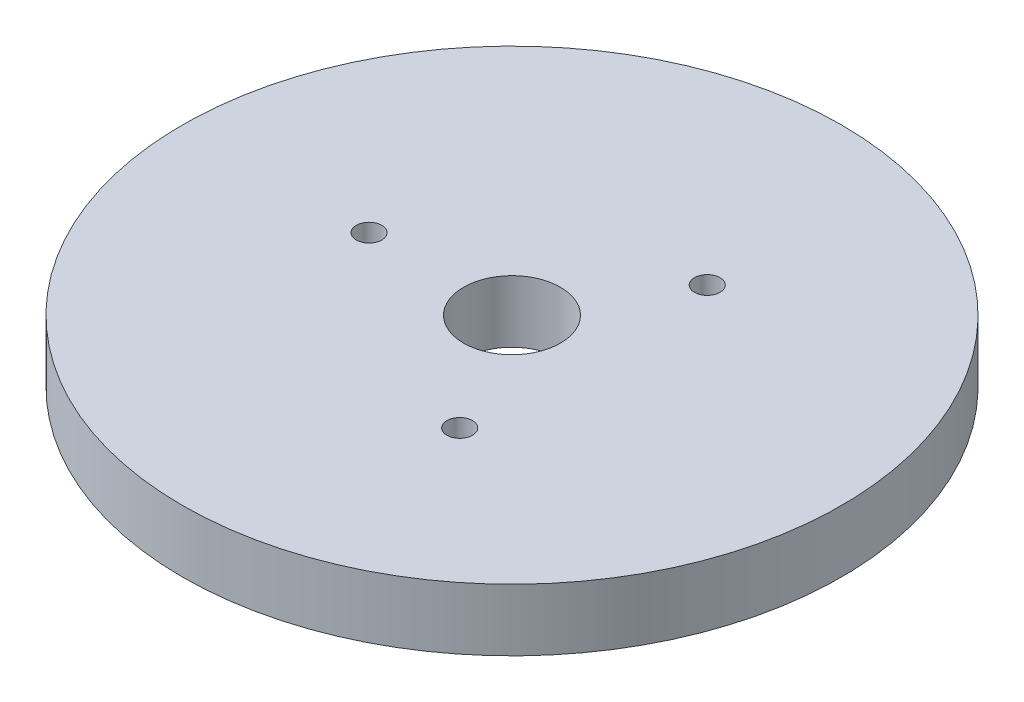
ISO-10303-21;
HEADER;
FILE_DESCRIPTION(('STEP AP214'),'2;1');
FILE_NAME('part.step','',(''),(''),'','','');
FILE_SCHEMA(('AUTOMOTIVE_DESIGN { 1 0 10303 214 1 1 1 1 }'));
ENDSEC;
DATA;
#1=APPLICATION_CONTEXT('core data for automotive mechanical design processes');
#2=APPLICATION_PROTOCOL_DEFINITION('international standard','automotive_design',2000,#1);
#3=PRODUCT_CONTEXT('',#1,'mechanical');
#4=PRODUCT('Part','Part','',(#3));
#5=PRODUCT_RELATED_PRODUCT_CATEGORY('part','',(#4));
#6=PRODUCT_DEFINITION_FORMATION('','',#4);
#7=PRODUCT_DEFINITION_CONTEXT('part definition',#1,'design');
#8=PRODUCT_DEFINITION('design','',#6,#7);
#9=PRODUCT_DEFINITION_SHAPE('','',#8);
#10=(LENGTH_UNIT() NAMED_UNIT(*) SI_UNIT(.MILLI.,.METRE.));
#11=(NAMED_UNIT(*) PLANE_ANGLE_UNIT() SI_UNIT($,.RADIAN.));
#12=(NAMED_UNIT(*) SI_UNIT($,.STERADIAN.) SOLID_ANGLE_UNIT());
#13=UNCERTAINTY_MEASURE_WITH_UNIT(LENGTH_MEASURE(1.E-05),#10,'distance_accuracy_value','');
#14=(GEOMETRIC_REPRESENTATION_CONTEXT(3) GLOBAL_UNCERTAINTY_ASSIGNED_CONTEXT((#13)) GLOBAL_UNIT_ASSIGNED_CONTEXT((#10,
#11,#12)) REPRESENTATION_CONTEXT('',''));
#15=CARTESIAN_POINT('',(0.,0.,0.));
#16=DIRECTION('',(0.,0.,1.));
#17=DIRECTION('',(1.,0.,0.));
#18=AXIS2_PLACEMENT_3D('',#15,#16,#17);
#19=CARTESIAN_POINT('',(0.,16.,0.));
#20=DIRECTION('',(0.,-1.,0.));
#21=DIRECTION('',(0.,0.,-1.));
#22=AXIS2_PLACEMENT_3D('',#19,#20,#21);
#23=CYLINDRICAL_SURFACE('',#22,85.);
#24=CARTESIAN_POINT('',(0.,16.,0.));
#25=DIRECTION('',(0.,1.,0.));
#26=DIRECTION('',(0.,0.,1.));
#27=AXIS2_PLACEMENT_3D('',#24,#25,#26);
#28=CIRCLE('',#27,85.);
#29=CARTESIAN_POINT('',(0.,16.,85.));
#30=VERTEX_POINT('',#29);
#31=EDGE_CURVE('E10',#30,#30,#28,.T.);
#32=ORIENTED_EDGE('',*,*,#31,.F.);
#33=EDGE_LOOP('',(#32));
#34=FACE_BOUND('',#33,.T.);
#35=CARTESIAN_POINT('',(0.,0.,0.));
#36=DIRECTION('',(0.,1.,0.));
#37=DIRECTION('',(0.,0.,1.));
#38=AXIS2_PLACEMENT_3D('',#35,#36,#37);
#39=CIRCLE('',#38,85.);
#40=CARTESIAN_POINT('',(0.,0.,85.));
#41=VERTEX_POINT('',#40);
#42=EDGE_CURVE('E37',#41,#41,#39,.T.);
#43=ORIENTED_EDGE('',*,*,#42,.T.);
#44=EDGE_LOOP('',(#43));
#45=FACE_BOUND('',#44,.T.);
#46=ADVANCED_FACE('F40',(#34,#45),#23,.T.);
#47=CARTESIAN_POINT('',(0.,16.,0.));
#48=DIRECTION('',(0.,1.,0.));
#49=DIRECTION('',(0.,0.,1.));
#50=AXIS2_PLACEMENT_3D('',#47,#48,#49);
#51=PLANE('',#50);
#52=CARTESIAN_POINT('',(18.4331883568552,16.,31.9272187795599));
#53=DIRECTION('',(0.,1.,0.));
#54=DIRECTION('',(0.866025403784436,0.,-0.500000000000004));
#55=AXIS2_PLACEMENT_3D('',#52,#53,#54);
#56=CIRCLE('',#55,3.29468462686718);
#57=CARTESIAN_POINT('',(18.4331883568552,16.,35.2219034064271));
#58=VERTEX_POINT('',#57);
#59=EDGE_CURVE('E70',#58,#58,#56,.T.);
#60=ORIENTED_EDGE('',*,*,#59,.F.);
#61=EDGE_LOOP('',(#60));
#62=FACE_BOUND('',#61,.T.);
#63=CARTESIAN_POINT('',(18.4331883568547,16.,-31.9272187795602));
#64=DIRECTION('',(0.,1.,0.));
#65=DIRECTION('',(-0.866025403784443,0.,-0.499999999999992));
#66=AXIS2_PLACEMENT_3D('',#63,#64,#65);
#67=CIRCLE('',#66,3.29468462686718);
#68=CARTESIAN_POINT('',(18.4331883568547,16.,-28.632534152693));
#69=VERTEX_POINT('',#68);
#70=EDGE_CURVE('E61',#69,#69,#67,.T.);
#71=ORIENTED_EDGE('',*,*,#70,.F.);
#72=EDGE_LOOP('',(#71));
#73=FACE_BOUND('',#72,.T.);
#74=CARTESIAN_POINT('',(-36.8663767137101,16.,0.));
#75=DIRECTION('',(0.,1.,0.));
#76=DIRECTION('',(0.,0.,1.));
#77=AXIS2_PLACEMENT_3D('',#74,#75,#76);
#78=CIRCLE('',#77,3.29468462686718);
#79=CARTESIAN_POINT('',(-36.8663767137101,16.,3.29468462686718));
#80=VERTEX_POINT('',#79);
#81=EDGE_CURVE('E54',#80,#80,#78,.T.);
#82=ORIENTED_EDGE('',*,*,#81,.F.);
#83=EDGE_LOOP('',(#82));
#84=FACE_BOUND('',#83,.T.);
#85=CARTESIAN_POINT('',(0.,16.,0.));
#86=DIRECTION('',(0.,1.,0.));
#87=DIRECTION('',(0.,0.,1.));
#88=AXIS2_PLACEMENT_3D('',#85,#86,#87);
#89=CIRCLE('',#88,12.5);
#90=CARTESIAN_POINT('',(0.,16.,12.5));
#91=VERTEX_POINT('',#90);
#92=EDGE_CURVE('E50',#91,#91,#89,.T.);
#93=ORIENTED_EDGE('',*,*,#92,.F.);
#94=EDGE_LOOP('',(#93));
#95=FACE_BOUND('',#94,.T.);
#96=ORIENTED_EDGE('',*,*,#31,.T.);
#97=EDGE_LOOP('',(#96));
#98=FACE_BOUND('',#97,.T.);
#99=ADVANCED_FACE('F85',(#62,#73,#84,#95,#98),#51,.T.);
#100=CARTESIAN_POINT('',(0.,0.,0.));
#101=DIRECTION('',(0.,1.,0.));
#102=DIRECTION('',(0.,0.,1.));
#103=AXIS2_PLACEMENT_3D('',#100,#101,#102);
#104=PLANE('',#103);
#105=CARTESIAN_POINT('',(0.,0.,0.));
#106=DIRECTION('',(0.,1.,0.));
#107=DIRECTION('',(0.,0.,1.));
#108=AXIS2_PLACEMENT_3D('',#105,#106,#107);
#109=CIRCLE('',#108,12.5);
#110=CARTESIAN_POINT('',(0.,0.,12.5));
#111=VERTEX_POINT('',#110);
#112=EDGE_CURVE('E47',#111,#111,#109,.T.);
#113=ORIENTED_EDGE('',*,*,#112,.T.);
#114=EDGE_LOOP('',(#113));
#115=FACE_BOUND('',#114,.T.);
#116=ORIENTED_EDGE('',*,*,#42,.F.);
#117=EDGE_LOOP('',(#116));
#118=FACE_BOUND('',#117,.T.);
#119=ADVANCED_FACE('F84',(#115,#118),#104,.F.);
#120=CARTESIAN_POINT('',(0.,16.,0.));
#121=DIRECTION('',(0.,-1.,0.));
#122=DIRECTION('',(0.,0.,-1.));
#123=AXIS2_PLACEMENT_3D('',#120,#121,#122);
#124=CYLINDRICAL_SURFACE('',#123,12.5);
#125=ORIENTED_EDGE('',*,*,#92,.T.);
#126=EDGE_LOOP('',(#125));
#127=FACE_BOUND('',#126,.T.);
#128=ORIENTED_EDGE('',*,*,#112,.F.);
#129=EDGE_LOOP('',(#128));
#130=FACE_BOUND('',#129,.T.);
#131=ADVANCED_FACE('F91',(#127,#130),#124,.F.);
#132=CARTESIAN_POINT('',(-36.8663767137101,3.00222049839914,0.));
#133=DIRECTION('',(0.,1.,0.));
#134=DIRECTION('',(0.,0.,1.));
#135=AXIS2_PLACEMENT_3D('',#132,#133,#134);
#136=CYLINDRICAL_SURFACE('',#135,3.29468462686718);
#137=CARTESIAN_POINT('',(-36.8663767137101,3.00222049839914,0.));
#138=DIRECTION('',(0.,1.,0.));
#139=DIRECTION('',(0.,0.,1.));
#140=AXIS2_PLACEMENT_3D('',#137,#138,#139);
#141=CIRCLE('',#140,3.29468462686718);
#142=CARTESIAN_POINT('',(-36.8663767137101,3.00222049839914,3.29468462686718));
#143=VERTEX_POINT('',#142);
#144=EDGE_CURVE('E55',#143,#143,#141,.T.);
#145=CARTESIAN_POINT('',(-36.8663767137101,3.00222049839914,3.29468462686718));
#146=CARTESIAN_POINT('',(-36.8663767137101,3.13761403487415,3.29468462686718));
#147=CARTESIAN_POINT('',(-36.8663767137101,3.27300757134916,3.29468462686718));
#148=CARTESIAN_POINT('',(-36.8663767137101,3.54379464429918,3.29468462686718));
#149=CARTESIAN_POINT('',(-36.8663767137101,3.67918818077419,3.29468462686718));
#150=CARTESIAN_POINT('',(-36.8663767137101,3.94997525372421,3.29468462686718));
#151=CARTESIAN_POINT('',(-36.8663767137101,4.08536879019921,3.29468462686718));
#152=CARTESIAN_POINT('',(-36.8663767137101,4.35615586314923,3.29468462686718));
#153=CARTESIAN_POINT('',(-36.8663767137101,4.49154939962424,3.29468462686718));
#154=CARTESIAN_POINT('',(-36.8663767137101,4.76233647257426,3.29468462686718));
#155=CARTESIAN_POINT('',(-36.8663767137101,4.89773000904927,3.29468462686718));
#156=CARTESIAN_POINT('',(-36.8663767137101,5.16851708199929,3.29468462686718));
#157=CARTESIAN_POINT('',(-36.8663767137101,5.30391061847429,3.29468462686718));
#158=CARTESIAN_POINT('',(-36.8663767137101,5.57469769142431,3.29468462686718));
#159=CARTESIAN_POINT('',(-36.8663767137101,5.71009122789932,3.29468462686718));
#160=CARTESIAN_POINT('',(-36.8663767137101,5.98087830084934,3.29468462686718));
#161=CARTESIAN_POINT('',(-36.8663767137101,6.11627183732435,3.29468462686718));
#162=CARTESIAN_POINT('',(-36.8663767137101,6.38705891027436,3.29468462686718));
#163=CARTESIAN_POINT('',(-36.8663767137101,6.52245244674937,3.29468462686718));
#164=CARTESIAN_POINT('',(-36.8663767137101,6.79323951969939,3.29468462686718));
#165=CARTESIAN_POINT('',(-36.8663767137101,6.9286330561744,3.29468462686718));
#166=CARTESIAN_POINT('',(-36.8663767137101,7.19942012912442,3.29468462686718));
#167=CARTESIAN_POINT('',(-36.8663767137101,7.33481366559943,3.29468462686718));
#168=CARTESIAN_POINT('',(-36.8663767137101,7.60560073854945,3.29468462686718));
#169=CARTESIAN_POINT('',(-36.8663767137101,7.74099427502445,3.29468462686718));
#170=CARTESIAN_POINT('',(-36.8663767137101,8.01178134797447,3.29468462686718));
#171=CARTESIAN_POINT('',(-36.8663767137101,8.14717488444948,3.29468462686718));
#172=CARTESIAN_POINT('',(-36.8663767137101,8.4179619573995,3.29468462686718));
#173=CARTESIAN_POINT('',(-36.8663767137101,8.55335549387451,3.29468462686718));
#174=CARTESIAN_POINT('',(-36.8663767137101,8.82414256682453,3.29468462686718));
#175=CARTESIAN_POINT('',(-36.8663767137101,8.95953610329953,3.29468462686718));
#176=CARTESIAN_POINT('',(-36.8663767137101,9.23032317624955,3.29468462686718));
#177=CARTESIAN_POINT('',(-36.8663767137101,9.36571671272456,3.29468462686718));
#178=CARTESIAN_POINT('',(-36.8663767137101,9.63650378567458,3.29468462686718));
#179=CARTESIAN_POINT('',(-36.8663767137101,9.77189732214959,3.29468462686718));
#180=CARTESIAN_POINT('',(-36.8663767137101,10.0426843950996,3.29468462686718));
#181=CARTESIAN_POINT('',(-36.8663767137101,10.1780779315746,3.29468462686718));
#182=CARTESIAN_POINT('',(-36.8663767137101,10.4488650045246,3.29468462686718));
#183=CARTESIAN_POINT('',(-36.8663767137101,10.5842585409996,3.29468462686718));
#184=CARTESIAN_POINT('',(-36.8663767137101,10.8550456139497,3.29468462686718));
#185=CARTESIAN_POINT('',(-36.8663767137101,10.9904391504247,3.29468462686718));
#186=CARTESIAN_POINT('',(-36.8663767137101,11.2612262233747,3.29468462686718));
#187=CARTESIAN_POINT('',(-36.8663767137101,11.3966197598497,3.29468462686718));
#188=CARTESIAN_POINT('',(-36.8663767137101,11.6674068327997,3.29468462686718));
#189=CARTESIAN_POINT('',(-36.8663767137101,11.8028003692747,3.29468462686718));
#190=CARTESIAN_POINT('',(-36.8663767137101,12.0735874422247,3.29468462686718));
#191=CARTESIAN_POINT('',(-36.8663767137101,12.2089809786997,3.29468462686718));
#192=CARTESIAN_POINT('',(-36.8663767137101,12.4797680516498,3.29468462686718));
#193=CARTESIAN_POINT('',(-36.8663767137101,12.6151615881248,3.29468462686718));
#194=CARTESIAN_POINT('',(-36.8663767137101,12.8859486610748,3.29468462686718));
#195=CARTESIAN_POINT('',(-36.8663767137101,13.0213421975498,3.29468462686718));
#196=CARTESIAN_POINT('',(-36.8663767137101,13.2921292704998,3.29468462686718));
#197=CARTESIAN_POINT('',(-36.8663767137101,13.4275228069748,3.29468462686718));
#198=CARTESIAN_POINT('',(-36.8663767137101,13.6983098799248,3.29468462686718));
#199=CARTESIAN_POINT('',(-36.8663767137101,13.8337034163999,3.29468462686718));
#200=CARTESIAN_POINT('',(-36.8663767137101,14.1044904893499,3.29468462686718));
#201=CARTESIAN_POINT('',(-36.8663767137101,14.2398840258249,3.29468462686718));
#202=CARTESIAN_POINT('',(-36.8663767137101,14.5106710987749,3.29468462686718));
#203=CARTESIAN_POINT('',(-36.8663767137101,14.6460646352499,3.29468462686718));
#204=CARTESIAN_POINT('',(-36.8663767137101,14.9168517081999,3.29468462686718));
#205=CARTESIAN_POINT('',(-36.8663767137101,15.0522452446749,3.29468462686718));
#206=CARTESIAN_POINT('',(-36.8663767137101,15.323032317625,3.29468462686718));
#207=CARTESIAN_POINT('',(-36.8663767137101,15.4584258541,3.29468462686718));
#208=CARTESIAN_POINT('',(-36.8663767137101,15.72921292705,3.29468462686718));
#209=CARTESIAN_POINT('',(-36.8663767137101,15.864606463525,3.29468462686718));
#210=CARTESIAN_POINT('',(-36.8663767137101,16.,3.29468462686718));
#211=B_SPLINE_CURVE_WITH_KNOTS('',3,(#145,#146,#147,#148,#149,#150,#151,#152,#153,#154,#155,
#156,#157,#158,#159,#160,#161,#162,#163,#164,#165,#166,#167,#168,#169,#170,#171,#172,#173,#174,
#175,#176,#177,#178,#179,#180,#181,#182,#183,#184,#185,#186,#187,#188,#189,#190,#191,#192,#193,
#194,#195,#196,#197,#198,#199,#200,#201,#202,#203,#204,#205,#206,#207,#208,#209,#210),
.UNSPECIFIED.,.F.,.F.,(4,2,2,2,2,2,2,2,2,2,2,2,2,2,2,2,2,2,2,2,2,2,2,2,2,2,2,2,2,2,2,2,4),(0.,
0.406180609425026,0.812361218850053,1.21854182827508,1.62472243770011,2.03090304712513,
2.43708365655016,2.84326426597519,3.24944487540021,3.65562548482524,4.06180609425027,
4.46798670367529,4.87416731310032,5.28034792252535,5.68652853195037,6.0927091413754,
6.49888975080043,6.90507036022546,7.31125096965048,7.71743157907551,8.12361218850053,
8.52979279792556,8.93597340735059,9.34215401677561,9.74833462620064,10.1545152356257,
10.5606958450507,10.9668764544757,11.3730570639007,11.7792376733258,12.1854182827508,
12.5915988921758,12.9977795016009),.UNSPECIFIED.);
#212=EDGE_CURVE('BSEAM96',#143,#80,#211,.T.);
#213=ORIENTED_EDGE('',*,*,#144,.F.);
#214=ORIENTED_EDGE('',*,*,#81,.T.);
#215=ORIENTED_EDGE('',*,*,#212,.T.);
#216=ORIENTED_EDGE('',*,*,#212,.F.);
#217=EDGE_LOOP('',(#213,#215,#214,#216));
#218=FACE_BOUND('',#217,.T.);
#219=ADVANCED_FACE('F96',(#218),#136,.F.);
#220=CARTESIAN_POINT('',(-36.8663767137101,3.00222049839914,0.));
#221=DIRECTION('',(0.,1.,0.));
#222=DIRECTION('',(0.,0.,1.));
#223=AXIS2_PLACEMENT_3D('',#220,#221,#222);
#224=PLANE('',#223);
#225=ORIENTED_EDGE('',*,*,#144,.T.);
#226=EDGE_LOOP('',(#225));
#227=FACE_BOUND('',#226,.T.);
#228=ADVANCED_FACE('F127',(#227),#224,.T.);
#229=CARTESIAN_POINT('',(18.4331883568547,3.00222049839914,-31.9272187795602));
#230=DIRECTION('',(0.,1.,0.));
#231=DIRECTION('',(0.,0.,1.));
#232=AXIS2_PLACEMENT_3D('',#229,#230,#231);
#233=CYLINDRICAL_SURFACE('',#232,3.29468462686718);
#234=CARTESIAN_POINT('',(18.4331883568547,3.00222049839914,-31.9272187795602));
#235=DIRECTION('',(0.,1.,0.));
#236=DIRECTION('',(-0.866025403784443,0.,-0.499999999999992));
#237=AXIS2_PLACEMENT_3D('',#234,#235,#236);
#238=CIRCLE('',#237,3.29468462686718);
#239=CARTESIAN_POINT('',(18.4331883568547,3.00222049839914,-28.632534152693));
#240=VERTEX_POINT('',#239);
#241=EDGE_CURVE('E63',#240,#240,#238,.T.);
#242=CARTESIAN_POINT('',(18.4331883568547,3.00222049839914,-28.632534152693));
#243=CARTESIAN_POINT('',(18.4331883568547,3.13761403487415,-28.632534152693));
#244=CARTESIAN_POINT('',(18.4331883568547,3.27300757134916,-28.632534152693));
#245=CARTESIAN_POINT('',(18.4331883568547,3.54379464429918,-28.632534152693));
#246=CARTESIAN_POINT('',(18.4331883568547,3.67918818077419,-28.632534152693));
#247=CARTESIAN_POINT('',(18.4331883568547,3.94997525372421,-28.632534152693));
#248=CARTESIAN_POINT('',(18.4331883568547,4.08536879019921,-28.632534152693));
#249=CARTESIAN_POINT('',(18.4331883568547,4.35615586314923,-28.632534152693));
#250=CARTESIAN_POINT('',(18.4331883568547,4.49154939962424,-28.632534152693));
#251=CARTESIAN_POINT('',(18.4331883568547,4.76233647257426,-28.632534152693));
#252=CARTESIAN_POINT('',(18.4331883568547,4.89773000904927,-28.632534152693));
#253=CARTESIAN_POINT('',(18.4331883568547,5.16851708199929,-28.632534152693));
#254=CARTESIAN_POINT('',(18.4331883568547,5.30391061847429,-28.632534152693));
#255=CARTESIAN_POINT('',(18.4331883568547,5.57469769142431,-28.632534152693));
#256=CARTESIAN_POINT('',(18.4331883568547,5.71009122789932,-28.632534152693));
#257=CARTESIAN_POINT('',(18.4331883568547,5.98087830084934,-28.632534152693));
#258=CARTESIAN_POINT('',(18.4331883568547,6.11627183732435,-28.632534152693));
#259=CARTESIAN_POINT('',(18.4331883568547,6.38705891027436,-28.632534152693));
#260=CARTESIAN_POINT('',(18.4331883568547,6.52245244674937,-28.632534152693));
#261=CARTESIAN_POINT('',(18.4331883568547,6.79323951969939,-28.632534152693));
#262=CARTESIAN_POINT('',(18.4331883568547,6.9286330561744,-28.632534152693));
#263=CARTESIAN_POINT('',(18.4331883568547,7.19942012912442,-28.632534152693));
#264=CARTESIAN_POINT('',(18.4331883568547,7.33481366559943,-28.632534152693));
#265=CARTESIAN_POINT('',(18.4331883568547,7.60560073854945,-28.632534152693));
#266=CARTESIAN_POINT('',(18.4331883568547,7.74099427502445,-28.632534152693));
#267=CARTESIAN_POINT('',(18.4331883568547,8.01178134797447,-28.632534152693));
#268=CARTESIAN_POINT('',(18.4331883568547,8.14717488444948,-28.632534152693));
#269=CARTESIAN_POINT('',(18.4331883568547,8.4179619573995,-28.632534152693));
#270=CARTESIAN_POINT('',(18.4331883568547,8.55335549387451,-28.632534152693));
#271=CARTESIAN_POINT('',(18.4331883568547,8.82414256682453,-28.632534152693));
#272=CARTESIAN_POINT('',(18.4331883568547,8.95953610329953,-28.632534152693));
#273=CARTESIAN_POINT('',(18.4331883568547,9.23032317624955,-28.632534152693));
#274=CARTESIAN_POINT('',(18.4331883568547,9.36571671272456,-28.632534152693));
#275=CARTESIAN_POINT('',(18.4331883568547,9.63650378567458,-28.632534152693));
#276=CARTESIAN_POINT('',(18.4331883568547,9.77189732214959,-28.632534152693));
#277=CARTESIAN_POINT('',(18.4331883568547,10.0426843950996,-28.632534152693));
#278=CARTESIAN_POINT('',(18.4331883568547,10.1780779315746,-28.632534152693));
#279=CARTESIAN_POINT('',(18.4331883568547,10.4488650045246,-28.632534152693));
#280=CARTESIAN_POINT('',(18.4331883568547,10.5842585409996,-28.632534152693));
#281=CARTESIAN_POINT('',(18.4331883568547,10.8550456139497,-28.632534152693));
#282=CARTESIAN_POINT('',(18.4331883568547,10.9904391504247,-28.632534152693));
#283=CARTESIAN_POINT('',(18.4331883568547,11.2612262233747,-28.632534152693));
#284=CARTESIAN_POINT('',(18.4331883568547,11.3966197598497,-28.632534152693));
#285=CARTESIAN_POINT('',(18.4331883568547,11.6674068327997,-28.632534152693));
#286=CARTESIAN_POINT('',(18.4331883568547,11.8028003692747,-28.632534152693));
#287=CARTESIAN_POINT('',(18.4331883568547,12.0735874422247,-28.632534152693));
#288=CARTESIAN_POINT('',(18.4331883568547,12.2089809786997,-28.632534152693));
#289=CARTESIAN_POINT('',(18.4331883568547,12.4797680516498,-28.632534152693));
#290=CARTESIAN_POINT('',(18.4331883568547,12.6151615881248,-28.632534152693));
#291=CARTESIAN_POINT('',(18.4331883568547,12.8859486610748,-28.632534152693));
#292=CARTESIAN_POINT('',(18.4331883568547,13.0213421975498,-28.632534152693));
#293=CARTESIAN_POINT('',(18.4331883568547,13.2921292704998,-28.632534152693));
#294=CARTESIAN_POINT('',(18.4331883568547,13.4275228069748,-28.632534152693));
#295=CARTESIAN_POINT('',(18.4331883568547,13.6983098799248,-28.632534152693));
#296=CARTESIAN_POINT('',(18.4331883568547,13.8337034163999,-28.632534152693));
#297=CARTESIAN_POINT('',(18.4331883568547,14.1044904893499,-28.632534152693));
#298=CARTESIAN_POINT('',(18.4331883568547,14.2398840258249,-28.632534152693));
#299=CARTESIAN_POINT('',(18.4331883568547,14.5106710987749,-28.632534152693));
#300=CARTESIAN_POINT('',(18.4331883568547,14.6460646352499,-28.632534152693));
#301=CARTESIAN_POINT('',(18.4331883568547,14.9168517081999,-28.632534152693));
#302=CARTESIAN_POINT('',(18.4331883568547,15.0522452446749,-28.632534152693));
#303=CARTESIAN_POINT('',(18.4331883568547,15.323032317625,-28.632534152693));
#304=CARTESIAN_POINT('',(18.4331883568547,15.4584258541,-28.632534152693));
#305=CARTESIAN_POINT('',(18.4331883568547,15.72921292705,-28.632534152693));
#306=CARTESIAN_POINT('',(18.4331883568547,15.864606463525,-28.632534152693));
#307=CARTESIAN_POINT('',(18.4331883568547,16.,-28.632534152693));
#308=B_SPLINE_CURVE_WITH_KNOTS('',3,(#242,#243,#244,#245,#246,#247,#248,#249,#250,#251,#252,
#253,#254,#255,#256,#257,#258,#259,#260,#261,#262,#263,#264,#265,#266,#267,#268,#269,#270,#271,
#272,#273,#274,#275,#276,#277,#278,#279,#280,#281,#282,#283,#284,#285,#286,#287,#288,#289,#290,
#291,#292,#293,#294,#295,#296,#297,#298,#299,#300,#301,#302,#303,#304,#305,#306,#307),
.UNSPECIFIED.,.F.,.F.,(4,2,2,2,2,2,2,2,2,2,2,2,2,2,2,2,2,2,2,2,2,2,2,2,2,2,2,2,2,2,2,2,4),(0.,
0.406180609425026,0.812361218850053,1.21854182827508,1.62472243770011,2.03090304712513,
2.43708365655016,2.84326426597519,3.24944487540021,3.65562548482524,4.06180609425027,
4.46798670367529,4.87416731310032,5.28034792252535,5.68652853195037,6.0927091413754,
6.49888975080043,6.90507036022546,7.31125096965048,7.71743157907551,8.12361218850053,
8.52979279792556,8.93597340735059,9.34215401677561,9.74833462620064,10.1545152356257,
10.5606958450507,10.9668764544757,11.3730570639007,11.7792376733258,12.1854182827508,
12.5915988921758,12.9977795016009),.UNSPECIFIED.);
#309=EDGE_CURVE('BSEAM133',#240,#69,#308,.T.);
#310=ORIENTED_EDGE('',*,*,#241,.F.);
#311=ORIENTED_EDGE('',*,*,#70,.T.);
#312=ORIENTED_EDGE('',*,*,#309,.T.);
#313=ORIENTED_EDGE('',*,*,#309,.F.);
#314=EDGE_LOOP('',(#310,#312,#311,#313));
#315=FACE_BOUND('',#314,.T.);
#316=ADVANCED_FACE('F133',(#315),#233,.F.);
#317=CARTESIAN_POINT('',(18.4331883568547,3.00222049839914,-31.9272187795602));
#318=DIRECTION('',(0.,1.,0.));
#319=DIRECTION('',(-0.866025403784443,0.,-0.499999999999992));
#320=AXIS2_PLACEMENT_3D('',#317,#318,#319);
#321=PLANE('',#320);
#322=ORIENTED_EDGE('',*,*,#241,.T.);
#323=EDGE_LOOP('',(#322));
#324=FACE_BOUND('',#323,.T.);
#325=ADVANCED_FACE('F77',(#324),#321,.T.);
#326=CARTESIAN_POINT('',(18.4331883568552,3.00222049839914,31.9272187795599));
#327=DIRECTION('',(0.,1.,0.));
#328=DIRECTION('',(0.,0.,1.));
#329=AXIS2_PLACEMENT_3D('',#326,#327,#328);
#330=CYLINDRICAL_SURFACE('',#329,3.29468462686718);
#331=CARTESIAN_POINT('',(18.4331883568552,3.00222049839914,31.9272187795599));
#332=DIRECTION('',(0.,1.,0.));
#333=DIRECTION('',(0.866025403784436,0.,-0.500000000000004));
#334=AXIS2_PLACEMENT_3D('',#331,#332,#333);
#335=CIRCLE('',#334,3.29468462686718);
#336=CARTESIAN_POINT('',(18.4331883568552,3.00222049839914,35.2219034064271));
#337=VERTEX_POINT('',#336);
#338=EDGE_CURVE('E59',#337,#337,#335,.T.);
#339=CARTESIAN_POINT('',(18.4331883568552,3.00222049839914,35.2219034064271));
#340=CARTESIAN_POINT('',(18.4331883568552,3.13761403487415,35.2219034064271));
#341=CARTESIAN_POINT('',(18.4331883568552,3.27300757134916,35.2219034064271));
#342=CARTESIAN_POINT('',(18.4331883568552,3.54379464429918,35.2219034064271));
#343=CARTESIAN_POINT('',(18.4331883568552,3.67918818077419,35.2219034064271));
#344=CARTESIAN_POINT('',(18.4331883568552,3.94997525372421,35.2219034064271));
#345=CARTESIAN_POINT('',(18.4331883568552,4.08536879019921,35.2219034064271));
#346=CARTESIAN_POINT('',(18.4331883568552,4.35615586314923,35.2219034064271));
#347=CARTESIAN_POINT('',(18.4331883568552,4.49154939962424,35.2219034064271));
#348=CARTESIAN_POINT('',(18.4331883568552,4.76233647257426,35.2219034064271));
#349=CARTESIAN_POINT('',(18.4331883568552,4.89773000904927,35.2219034064271));
#350=CARTESIAN_POINT('',(18.4331883568552,5.16851708199929,35.2219034064271));
#351=CARTESIAN_POINT('',(18.4331883568552,5.30391061847429,35.2219034064271));
#352=CARTESIAN_POINT('',(18.4331883568552,5.57469769142431,35.2219034064271));
#353=CARTESIAN_POINT('',(18.4331883568552,5.71009122789932,35.2219034064271));
#354=CARTESIAN_POINT('',(18.4331883568552,5.98087830084934,35.2219034064271));
#355=CARTESIAN_POINT('',(18.4331883568552,6.11627183732435,35.2219034064271));
#356=CARTESIAN_POINT('',(18.4331883568552,6.38705891027436,35.2219034064271));
#357=CARTESIAN_POINT('',(18.4331883568552,6.52245244674937,35.2219034064271));
#358=CARTESIAN_POINT('',(18.4331883568552,6.79323951969939,35.2219034064271));
#359=CARTESIAN_POINT('',(18.4331883568552,6.9286330561744,35.2219034064271));
#360=CARTESIAN_POINT('',(18.4331883568552,7.19942012912442,35.2219034064271));
#361=CARTESIAN_POINT('',(18.4331883568552,7.33481366559943,35.2219034064271));
#362=CARTESIAN_POINT('',(18.4331883568552,7.60560073854945,35.2219034064271));
#363=CARTESIAN_POINT('',(18.4331883568552,7.74099427502445,35.2219034064271));
#364=CARTESIAN_POINT('',(18.4331883568552,8.01178134797447,35.2219034064271));
#365=CARTESIAN_POINT('',(18.4331883568552,8.14717488444948,35.2219034064271));
#366=CARTESIAN_POINT('',(18.4331883568552,8.4179619573995,35.2219034064271));
#367=CARTESIAN_POINT('',(18.4331883568552,8.55335549387451,35.2219034064271));
#368=CARTESIAN_POINT('',(18.4331883568552,8.82414256682453,35.2219034064271));
#369=CARTESIAN_POINT('',(18.4331883568552,8.95953610329953,35.2219034064271));
#370=CARTESIAN_POINT('',(18.4331883568552,9.23032317624955,35.2219034064271));
#371=CARTESIAN_POINT('',(18.4331883568552,9.36571671272456,35.2219034064271));
#372=CARTESIAN_POINT('',(18.4331883568552,9.63650378567458,35.2219034064271));
#373=CARTESIAN_POINT('',(18.4331883568552,9.77189732214959,35.2219034064271));
#374=CARTESIAN_POINT('',(18.4331883568552,10.0426843950996,35.2219034064271));
#375=CARTESIAN_POINT('',(18.4331883568552,10.1780779315746,35.2219034064271));
#376=CARTESIAN_POINT('',(18.4331883568552,10.4488650045246,35.2219034064271));
#377=CARTESIAN_POINT('',(18.4331883568552,10.5842585409996,35.2219034064271));
#378=CARTESIAN_POINT('',(18.4331883568552,10.8550456139497,35.2219034064271));
#379=CARTESIAN_POINT('',(18.4331883568552,10.9904391504247,35.2219034064271));
#380=CARTESIAN_POINT('',(18.4331883568552,11.2612262233747,35.2219034064271));
#381=CARTESIAN_POINT('',(18.4331883568552,11.3966197598497,35.2219034064271));
#382=CARTESIAN_POINT('',(18.4331883568552,11.6674068327997,35.2219034064271));
#383=CARTESIAN_POINT('',(18.4331883568552,11.8028003692747,35.2219034064271));
#384=CARTESIAN_POINT('',(18.4331883568552,12.0735874422247,35.2219034064271));
#385=CARTESIAN_POINT('',(18.4331883568552,12.2089809786997,35.2219034064271));
#386=CARTESIAN_POINT('',(18.4331883568552,12.4797680516498,35.2219034064271));
#387=CARTESIAN_POINT('',(18.4331883568552,12.6151615881248,35.2219034064271));
#388=CARTESIAN_POINT('',(18.4331883568552,12.8859486610748,35.2219034064271));
#389=CARTESIAN_POINT('',(18.4331883568552,13.0213421975498,35.2219034064271));
#390=CARTESIAN_POINT('',(18.4331883568552,13.2921292704998,35.2219034064271));
#391=CARTESIAN_POINT('',(18.4331883568552,13.4275228069748,35.2219034064271));
#392=CARTESIAN_POINT('',(18.4331883568552,13.6983098799248,35.2219034064271));
#393=CARTESIAN_POINT('',(18.4331883568552,13.8337034163999,35.2219034064271));
#394=CARTESIAN_POINT('',(18.4331883568552,14.1044904893499,35.2219034064271));
#395=CARTESIAN_POINT('',(18.4331883568552,14.2398840258249,35.2219034064271));
#396=CARTESIAN_POINT('',(18.4331883568552,14.5106710987749,35.2219034064271));
#397=CARTESIAN_POINT('',(18.4331883568552,14.6460646352499,35.2219034064271));
#398=CARTESIAN_POINT('',(18.4331883568552,14.9168517081999,35.2219034064271));
#399=CARTESIAN_POINT('',(18.4331883568552,15.0522452446749,35.2219034064271));
#400=CARTESIAN_POINT('',(18.4331883568552,15.323032317625,35.2219034064271));
#401=CARTESIAN_POINT('',(18.4331883568552,15.4584258541,35.2219034064271));
#402=CARTESIAN_POINT('',(18.4331883568552,15.72921292705,35.2219034064271));
#403=CARTESIAN_POINT('',(18.4331883568552,15.864606463525,35.2219034064271));
#404=CARTESIAN_POINT('',(18.4331883568552,16.,35.2219034064271));
#405=B_SPLINE_CURVE_WITH_KNOTS('',3,(#339,#340,#341,#342,#343,#344,#345,#346,#347,#348,#349,
#350,#351,#352,#353,#354,#355,#356,#357,#358,#359,#360,#361,#362,#363,#364,#365,#366,#367,#368,
#369,#370,#371,#372,#373,#374,#375,#376,#377,#378,#379,#380,#381,#382,#383,#384,#385,#386,#387,
#388,#389,#390,#391,#392,#393,#394,#395,#396,#397,#398,#399,#400,#401,#402,#403,#404),
.UNSPECIFIED.,.F.,.F.,(4,2,2,2,2,2,2,2,2,2,2,2,2,2,2,2,2,2,2,2,2,2,2,2,2,2,2,2,2,2,2,2,4),(0.,
0.406180609425026,0.812361218850053,1.21854182827508,1.62472243770011,2.03090304712513,
2.43708365655016,2.84326426597519,3.24944487540021,3.65562548482524,4.06180609425027,
4.46798670367529,4.87416731310032,5.28034792252535,5.68652853195037,6.0927091413754,
6.49888975080043,6.90507036022546,7.31125096965048,7.71743157907551,8.12361218850053,
8.52979279792556,8.93597340735059,9.34215401677561,9.74833462620064,10.1545152356257,
10.5606958450507,10.9668764544757,11.3730570639007,11.7792376733258,12.1854182827508,
12.5915988921758,12.9977795016009),.UNSPECIFIED.);
#406=EDGE_CURVE('BSEAM73',#337,#58,#405,.T.);
#407=ORIENTED_EDGE('',*,*,#338,.F.);
#408=ORIENTED_EDGE('',*,*,#59,.T.);
#409=ORIENTED_EDGE('',*,*,#406,.T.);
#410=ORIENTED_EDGE('',*,*,#406,.F.);
#411=EDGE_LOOP('',(#407,#409,#408,#410));
#412=FACE_BOUND('',#411,.T.);
#413=ADVANCED_FACE('F73',(#412),#330,.F.);
#414=CARTESIAN_POINT('',(18.4331883568552,3.00222049839914,31.9272187795599));
#415=DIRECTION('',(0.,1.,0.));
#416=DIRECTION('',(0.866025403784436,0.,-0.500000000000004));
#417=AXIS2_PLACEMENT_3D('',#414,#415,#416);
#418=PLANE('',#417);
#419=ORIENTED_EDGE('',*,*,#338,.T.);
#420=EDGE_LOOP('',(#419));
#421=FACE_BOUND('',#420,.T.);
#422=ADVANCED_FACE('F71',(#421),#418,.T.);
#423=CLOSED_SHELL('',(#46,#99,#119,#131,#219,#228,#316,#325,#413,#422));
#424=MANIFOLD_SOLID_BREP('B2',#423);
#425=ADVANCED_BREP_SHAPE_REPRESENTATION('',(#18,#424),#14);
#426=SHAPE_DEFINITION_REPRESENTATION(#9,#425);
ENDSEC;
END-ISO-10303-21;
